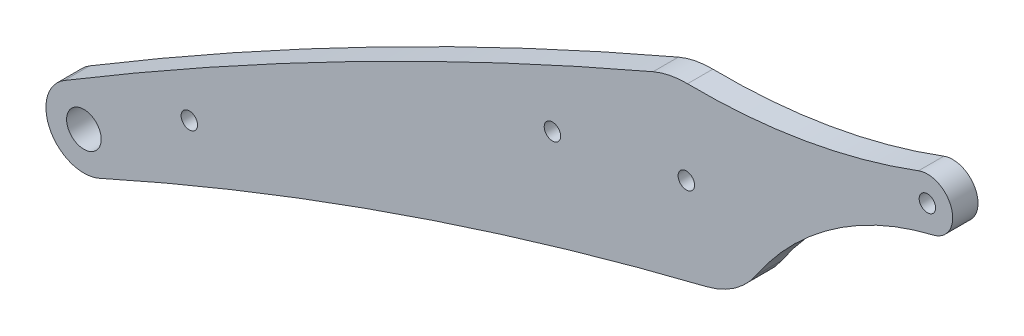
ISO-10303-21;
HEADER;
FILE_DESCRIPTION(('STEP AP214'),'2;1');
FILE_NAME('part.step','',(''),(''),'','','');
FILE_SCHEMA(('AUTOMOTIVE_DESIGN { 1 0 10303 214 1 1 1 1 }'));
ENDSEC;
DATA;
#1=APPLICATION_CONTEXT('core data for automotive mechanical design processes');
#2=APPLICATION_PROTOCOL_DEFINITION('international standard','automotive_design',2000,#1);
#3=PRODUCT_CONTEXT('',#1,'mechanical');
#4=PRODUCT('Part','Part','',(#3));
#5=PRODUCT_RELATED_PRODUCT_CATEGORY('part','',(#4));
#6=PRODUCT_DEFINITION_FORMATION('','',#4);
#7=PRODUCT_DEFINITION_CONTEXT('part definition',#1,'design');
#8=PRODUCT_DEFINITION('design','',#6,#7);
#9=PRODUCT_DEFINITION_SHAPE('','',#8);
#10=(LENGTH_UNIT() NAMED_UNIT(*) SI_UNIT(.MILLI.,.METRE.));
#11=(NAMED_UNIT(*) PLANE_ANGLE_UNIT() SI_UNIT($,.RADIAN.));
#12=(NAMED_UNIT(*) SI_UNIT($,.STERADIAN.) SOLID_ANGLE_UNIT());
#13=UNCERTAINTY_MEASURE_WITH_UNIT(LENGTH_MEASURE(1.E-05),#10,'distance_accuracy_value','');
#14=(GEOMETRIC_REPRESENTATION_CONTEXT(3) GLOBAL_UNCERTAINTY_ASSIGNED_CONTEXT((#13)) GLOBAL_UNIT_ASSIGNED_CONTEXT((#10,
#11,#12)) REPRESENTATION_CONTEXT('',''));
#15=CARTESIAN_POINT('',(0.,0.,0.));
#16=DIRECTION('',(0.,0.,1.));
#17=DIRECTION('',(1.,0.,0.));
#18=AXIS2_PLACEMENT_3D('',#15,#16,#17);
#19=CARTESIAN_POINT('',(120.891673391982,-338.257908013351,6.));
#20=DIRECTION('',(0.,0.,-1.));
#21=DIRECTION('',(-1.,0.,0.));
#22=AXIS2_PLACEMENT_3D('',#19,#20,#21);
#23=PLANE('',#22);
#24=CARTESIAN_POINT('',(343.845865484426,-857.40762459654,6.));
#25=DIRECTION('',(0.,0.,1.));
#26=DIRECTION('',(-1.,0.,0.));
#27=AXIS2_PLACEMENT_3D('',#24,#25,#26);
#28=CIRCLE('',#27,1150.);
#29=CARTESIAN_POINT('',(-109.954702491345,199.268789687827,6.));
#30=VERTEX_POINT('',#29);
#31=CARTESIAN_POINT('',(-249.547735748775,127.673100022257,6.));
#32=VERTEX_POINT('',#31);
#33=EDGE_CURVE('E146',#30,#32,#28,.T.);
#34=ORIENTED_EDGE('',*,*,#33,.T.);
#35=CARTESIAN_POINT('',(-244.90378582608,119.963772612197,6.));
#36=DIRECTION('',(0.,0.,1.));
#37=DIRECTION('',(1.,0.,0.));
#38=AXIS2_PLACEMENT_3D('',#35,#36,#37);
#39=CIRCLE('',#38,9.00000000000007);
#40=CARTESIAN_POINT('',(-241.215192404643,111.754370772152,6.));
#41=VERTEX_POINT('',#40);
#42=EDGE_CURVE('E94',#32,#41,#39,.T.);
#43=ORIENTED_EDGE('',*,*,#42,.T.);
#44=CARTESIAN_POINT('',(107.151964064457,-663.578025232061,6.));
#45=DIRECTION('',(0.,0.,-1.));
#46=DIRECTION('',(1.,0.,0.));
#47=AXIS2_PLACEMENT_3D('',#44,#45,#46);
#48=CIRCLE('',#47,850.);
#49=CARTESIAN_POINT('',(-97.2529903610391,161.478708942208,6.));
#50=VERTEX_POINT('',#49);
#51=EDGE_CURVE('E161',#41,#50,#48,.T.);
#52=ORIENTED_EDGE('',*,*,#51,.T.);
#53=CARTESIAN_POINT('',(-102.062518700463,180.891808569838,6.));
#54=DIRECTION('',(0.,0.,1.));
#55=DIRECTION('',(1.,0.,0.));
#56=AXIS2_PLACEMENT_3D('',#53,#54,#55);
#57=CIRCLE('',#56,20.0000000000002);
#58=CARTESIAN_POINT('',(-85.4373245270514,169.774123617638,6.));
#59=VERTEX_POINT('',#58);
#60=EDGE_CURVE('E174',#50,#59,#57,.T.);
#61=ORIENTED_EDGE('',*,*,#60,.T.);
#62=CARTESIAN_POINT('',(-27.2491449201124,130.862226284938,6.));
#63=DIRECTION('',(0.,0.,-1.));
#64=DIRECTION('',(-1.,0.,0.));
#65=AXIS2_PLACEMENT_3D('',#62,#63,#64);
#66=CIRCLE('',#65,70.);
#67=CARTESIAN_POINT('',(-43.5099983861352,198.947354209886,6.));
#68=VERTEX_POINT('',#67);
#69=EDGE_CURVE('E113',#59,#68,#66,.T.);
#70=ORIENTED_EDGE('',*,*,#69,.T.);
#71=CARTESIAN_POINT('',(-44.90378582608,204.783222317738,6.));
#72=DIRECTION('',(0.,0.,1.));
#73=DIRECTION('',(1.,0.,0.));
#74=AXIS2_PLACEMENT_3D('',#71,#72,#73);
#75=CIRCLE('',#74,6.00000000000002);
#76=CARTESIAN_POINT('',(-47.0081013739452,210.402106199348,6.));
#77=VERTEX_POINT('',#76);
#78=EDGE_CURVE('E107',#68,#77,#75,.T.);
#79=ORIENTED_EDGE('',*,*,#78,.T.);
#80=CARTESIAN_POINT('',(-99.6159900705748,350.874203239589,6.));
#81=DIRECTION('',(0.,0.,-1.));
#82=DIRECTION('',(1.,0.,0.));
#83=AXIS2_PLACEMENT_3D('',#80,#81,#82);
#84=CIRCLE('',#83,150.);
#85=CARTESIAN_POINT('',(-101.774691802829,200.889737354515,6.));
#86=VERTEX_POINT('',#85);
#87=EDGE_CURVE('E111',#77,#86,#84,.T.);
#88=ORIENTED_EDGE('',*,*,#87,.T.);
#89=CARTESIAN_POINT('',(-102.062518700463,180.891808569838,6.));
#90=DIRECTION('',(0.,0.,1.));
#91=DIRECTION('',(-1.,0.,0.));
#92=AXIS2_PLACEMENT_3D('',#89,#90,#91);
#93=CIRCLE('',#92,19.9999999999998);
#94=EDGE_CURVE('E51',#86,#30,#93,.T.);
#95=ORIENTED_EDGE('',*,*,#94,.T.);
#96=EDGE_LOOP('',(#34,#43,#52,#61,#70,#79,#88,#95));
#97=FACE_BOUND('',#96,.T.);
#98=CARTESIAN_POINT('',(-102.062518700463,180.891808569838,6.));
#99=DIRECTION('',(0.,0.,1.));
#100=DIRECTION('',(1.,0.,0.));
#101=AXIS2_PLACEMENT_3D('',#98,#99,#100);
#102=CIRCLE('',#101,1.95);
#103=CARTESIAN_POINT('',(-100.112518700463,180.891808569838,6.));
#104=VERTEX_POINT('',#103);
#105=EDGE_CURVE('E135',#104,#104,#102,.T.);
#106=ORIENTED_EDGE('',*,*,#105,.F.);
#107=EDGE_LOOP('',(#106));
#108=FACE_BOUND('',#107,.T.);
#109=CARTESIAN_POINT('',(-44.90378582608,204.783222317738,6.));
#110=DIRECTION('',(0.,0.,1.));
#111=DIRECTION('',(1.,0.,0.));
#112=AXIS2_PLACEMENT_3D('',#109,#110,#111);
#113=CIRCLE('',#112,1.95);
#114=CARTESIAN_POINT('',(-42.95378582608,204.783222317738,6.));
#115=VERTEX_POINT('',#114);
#116=EDGE_CURVE('E183',#115,#115,#113,.T.);
#117=ORIENTED_EDGE('',*,*,#116,.F.);
#118=EDGE_LOOP('',(#117));
#119=FACE_BOUND('',#118,.T.);
#120=CARTESIAN_POINT('',(-244.90378582608,119.963772612197,6.));
#121=DIRECTION('',(0.,0.,1.));
#122=DIRECTION('',(1.,0.,0.));
#123=AXIS2_PLACEMENT_3D('',#120,#121,#122);
#124=CIRCLE('',#123,4.09999999999998);
#125=CARTESIAN_POINT('',(-240.80378582608,119.963772612197,6.));
#126=VERTEX_POINT('',#125);
#127=EDGE_CURVE('E189',#126,#126,#124,.T.);
#128=ORIENTED_EDGE('',*,*,#127,.F.);
#129=EDGE_LOOP('',(#128));
#130=FACE_BOUND('',#129,.T.);
#131=CARTESIAN_POINT('',(-219.90378582608,134.304249979282,6.));
#132=DIRECTION('',(0.,0.,1.));
#133=DIRECTION('',(1.,0.,0.));
#134=AXIS2_PLACEMENT_3D('',#131,#132,#133);
#135=CIRCLE('',#134,1.95);
#136=CARTESIAN_POINT('',(-217.95378582608,134.304249979282,6.));
#137=VERTEX_POINT('',#136);
#138=EDGE_CURVE('E195',#137,#137,#135,.T.);
#139=ORIENTED_EDGE('',*,*,#138,.F.);
#140=EDGE_LOOP('',(#139));
#141=FACE_BOUND('',#140,.T.);
#142=CARTESIAN_POINT('',(-133.812518700463,175.069049715559,6.));
#143=DIRECTION('',(0.,0.,1.));
#144=DIRECTION('',(1.,0.,0.));
#145=AXIS2_PLACEMENT_3D('',#142,#143,#144);
#146=CIRCLE('',#145,1.95);
#147=CARTESIAN_POINT('',(-131.862518700463,175.069049715559,6.));
#148=VERTEX_POINT('',#147);
#149=EDGE_CURVE('E201',#148,#148,#146,.T.);
#150=ORIENTED_EDGE('',*,*,#149,.F.);
#151=EDGE_LOOP('',(#150));
#152=FACE_BOUND('',#151,.T.);
#153=ADVANCED_FACE('F34',(#97,#108,#119,#130,#141,#152),#23,.F.);
#154=CARTESIAN_POINT('',(120.891673391982,-338.257908013351,0.));
#155=DIRECTION('',(0.,0.,-1.));
#156=DIRECTION('',(-1.,0.,0.));
#157=AXIS2_PLACEMENT_3D('',#154,#155,#156);
#158=PLANE('',#157);
#159=CARTESIAN_POINT('',(-219.90378582608,134.304249979282,0.));
#160=DIRECTION('',(0.,0.,1.));
#161=DIRECTION('',(1.,0.,0.));
#162=AXIS2_PLACEMENT_3D('',#159,#160,#161);
#163=CIRCLE('',#162,1.95);
#164=CARTESIAN_POINT('',(-217.95378582608,134.304249979282,0.));
#165=VERTEX_POINT('',#164);
#166=EDGE_CURVE('E198',#165,#165,#163,.T.);
#167=ORIENTED_EDGE('',*,*,#166,.T.);
#168=EDGE_LOOP('',(#167));
#169=FACE_BOUND('',#168,.T.);
#170=CARTESIAN_POINT('',(-44.90378582608,204.783222317738,0.));
#171=DIRECTION('',(0.,0.,1.));
#172=DIRECTION('',(1.,0.,0.));
#173=AXIS2_PLACEMENT_3D('',#170,#171,#172);
#174=CIRCLE('',#173,1.95);
#175=CARTESIAN_POINT('',(-42.95378582608,204.783222317738,0.));
#176=VERTEX_POINT('',#175);
#177=EDGE_CURVE('E186',#176,#176,#174,.T.);
#178=ORIENTED_EDGE('',*,*,#177,.T.);
#179=EDGE_LOOP('',(#178));
#180=FACE_BOUND('',#179,.T.);
#181=CARTESIAN_POINT('',(343.845865484426,-857.40762459654,0.));
#182=DIRECTION('',(0.,0.,1.));
#183=DIRECTION('',(-1.,0.,0.));
#184=AXIS2_PLACEMENT_3D('',#181,#182,#183);
#185=CIRCLE('',#184,1150.);
#186=CARTESIAN_POINT('',(-109.954702491345,199.268789687827,0.));
#187=VERTEX_POINT('',#186);
#188=CARTESIAN_POINT('',(-249.547735748775,127.673100022257,0.));
#189=VERTEX_POINT('',#188);
#190=EDGE_CURVE('E131',#187,#189,#185,.T.);
#191=ORIENTED_EDGE('',*,*,#190,.F.);
#192=CARTESIAN_POINT('',(-102.062518700463,180.891808569838,0.));
#193=DIRECTION('',(0.,0.,1.));
#194=DIRECTION('',(-1.,0.,0.));
#195=AXIS2_PLACEMENT_3D('',#192,#193,#194);
#196=CIRCLE('',#195,19.9999999999998);
#197=CARTESIAN_POINT('',(-101.774691802829,200.889737354515,0.));
#198=VERTEX_POINT('',#197);
#199=EDGE_CURVE('E86',#198,#187,#196,.T.);
#200=ORIENTED_EDGE('',*,*,#199,.F.);
#201=CARTESIAN_POINT('',(-99.6159900705748,350.874203239589,0.));
#202=DIRECTION('',(0.,0.,-1.));
#203=DIRECTION('',(1.,0.,0.));
#204=AXIS2_PLACEMENT_3D('',#201,#202,#203);
#205=CIRCLE('',#204,150.);
#206=CARTESIAN_POINT('',(-47.0081013739452,210.402106199348,0.));
#207=VERTEX_POINT('',#206);
#208=EDGE_CURVE('E80',#207,#198,#205,.T.);
#209=ORIENTED_EDGE('',*,*,#208,.F.);
#210=CARTESIAN_POINT('',(-44.90378582608,204.783222317738,0.));
#211=DIRECTION('',(0.,0.,1.));
#212=DIRECTION('',(1.,0.,0.));
#213=AXIS2_PLACEMENT_3D('',#210,#211,#212);
#214=CIRCLE('',#213,6.00000000000002);
#215=CARTESIAN_POINT('',(-43.5099983861352,198.947354209886,0.));
#216=VERTEX_POINT('',#215);
#217=EDGE_CURVE('E121',#216,#207,#214,.T.);
#218=ORIENTED_EDGE('',*,*,#217,.F.);
#219=CARTESIAN_POINT('',(-27.2491449201124,130.862226284938,0.));
#220=DIRECTION('',(0.,0.,-1.));
#221=DIRECTION('',(-1.,0.,0.));
#222=AXIS2_PLACEMENT_3D('',#219,#220,#221);
#223=CIRCLE('',#222,70.);
#224=CARTESIAN_POINT('',(-85.4373245270514,169.774123617638,0.));
#225=VERTEX_POINT('',#224);
#226=EDGE_CURVE('E141',#225,#216,#223,.T.);
#227=ORIENTED_EDGE('',*,*,#226,.F.);
#228=CARTESIAN_POINT('',(-102.062518700463,180.891808569838,0.));
#229=DIRECTION('',(0.,0.,1.));
#230=DIRECTION('',(1.,0.,0.));
#231=AXIS2_PLACEMENT_3D('',#228,#229,#230);
#232=CIRCLE('',#231,20.0000000000002);
#233=CARTESIAN_POINT('',(-97.2529903610391,161.478708942208,0.));
#234=VERTEX_POINT('',#233);
#235=EDGE_CURVE('E139',#234,#225,#232,.T.);
#236=ORIENTED_EDGE('',*,*,#235,.F.);
#237=CARTESIAN_POINT('',(107.151964064457,-663.578025232061,0.));
#238=DIRECTION('',(0.,0.,-1.));
#239=DIRECTION('',(1.,0.,0.));
#240=AXIS2_PLACEMENT_3D('',#237,#238,#239);
#241=CIRCLE('',#240,850.);
#242=CARTESIAN_POINT('',(-241.215192404643,111.754370772152,0.));
#243=VERTEX_POINT('',#242);
#244=EDGE_CURVE('E137',#243,#234,#241,.T.);
#245=ORIENTED_EDGE('',*,*,#244,.F.);
#246=CARTESIAN_POINT('',(-244.90378582608,119.963772612197,0.));
#247=DIRECTION('',(0.,0.,1.));
#248=DIRECTION('',(1.,0.,0.));
#249=AXIS2_PLACEMENT_3D('',#246,#247,#248);
#250=CIRCLE('',#249,9.00000000000007);
#251=EDGE_CURVE('E134',#189,#243,#250,.T.);
#252=ORIENTED_EDGE('',*,*,#251,.F.);
#253=EDGE_LOOP('',(#191,#200,#209,#218,#227,#236,#245,#252));
#254=FACE_BOUND('',#253,.T.);
#255=CARTESIAN_POINT('',(-102.062518700463,180.891808569838,0.));
#256=DIRECTION('',(0.,0.,1.));
#257=DIRECTION('',(1.,0.,0.));
#258=AXIS2_PLACEMENT_3D('',#255,#256,#257);
#259=CIRCLE('',#258,1.95);
#260=CARTESIAN_POINT('',(-100.112518700463,180.891808569838,0.));
#261=VERTEX_POINT('',#260);
#262=EDGE_CURVE('E180',#261,#261,#259,.T.);
#263=ORIENTED_EDGE('',*,*,#262,.T.);
#264=EDGE_LOOP('',(#263));
#265=FACE_BOUND('',#264,.T.);
#266=CARTESIAN_POINT('',(-244.90378582608,119.963772612197,0.));
#267=DIRECTION('',(0.,0.,1.));
#268=DIRECTION('',(1.,0.,0.));
#269=AXIS2_PLACEMENT_3D('',#266,#267,#268);
#270=CIRCLE('',#269,4.09999999999998);
#271=CARTESIAN_POINT('',(-240.80378582608,119.963772612197,0.));
#272=VERTEX_POINT('',#271);
#273=EDGE_CURVE('E192',#272,#272,#270,.T.);
#274=ORIENTED_EDGE('',*,*,#273,.T.);
#275=EDGE_LOOP('',(#274));
#276=FACE_BOUND('',#275,.T.);
#277=CARTESIAN_POINT('',(-133.812518700463,175.069049715559,0.));
#278=DIRECTION('',(0.,0.,1.));
#279=DIRECTION('',(1.,0.,0.));
#280=AXIS2_PLACEMENT_3D('',#277,#278,#279);
#281=CIRCLE('',#280,1.95);
#282=CARTESIAN_POINT('',(-131.862518700463,175.069049715559,0.));
#283=VERTEX_POINT('',#282);
#284=EDGE_CURVE('E204',#283,#283,#281,.T.);
#285=ORIENTED_EDGE('',*,*,#284,.T.);
#286=EDGE_LOOP('',(#285));
#287=FACE_BOUND('',#286,.T.);
#288=ADVANCED_FACE('F165',(#169,#180,#254,#265,#276,#287),#158,.T.);
#289=CARTESIAN_POINT('',(343.845865484426,-857.40762459654,6.));
#290=DIRECTION('',(0.,0.,-1.));
#291=DIRECTION('',(-1.,0.,0.));
#292=AXIS2_PLACEMENT_3D('',#289,#290,#291);
#293=CYLINDRICAL_SURFACE('',#292,1150.);
#294=ORIENTED_EDGE('',*,*,#190,.T.);
#295=DIRECTION('',(0.,0.,-1.));
#296=VECTOR('',#295,1.);
#297=CARTESIAN_POINT('',(-249.547735748775,127.673100022257,6.));
#298=LINE('',#297,#296);
#299=EDGE_CURVE('E11',#32,#189,#298,.T.);
#300=ORIENTED_EDGE('',*,*,#299,.F.);
#301=ORIENTED_EDGE('',*,*,#33,.F.);
#302=DIRECTION('',(0.,0.,-1.));
#303=VECTOR('',#302,1.);
#304=CARTESIAN_POINT('',(-109.954702491345,199.268789687827,6.));
#305=LINE('',#304,#303);
#306=EDGE_CURVE('E127',#30,#187,#305,.T.);
#307=ORIENTED_EDGE('',*,*,#306,.T.);
#308=EDGE_LOOP('',(#294,#300,#301,#307));
#309=FACE_BOUND('',#308,.T.);
#310=ADVANCED_FACE('F36',(#309),#293,.T.);
#311=CARTESIAN_POINT('',(-244.90378582608,119.963772612197,6.));
#312=DIRECTION('',(0.,0.,-1.));
#313=DIRECTION('',(-1.,0.,0.));
#314=AXIS2_PLACEMENT_3D('',#311,#312,#313);
#315=CYLINDRICAL_SURFACE('',#314,9.00000000000007);
#316=ORIENTED_EDGE('',*,*,#251,.T.);
#317=DIRECTION('',(0.,0.,-1.));
#318=VECTOR('',#317,1.);
#319=CARTESIAN_POINT('',(-241.215192404643,111.754370772152,6.));
#320=LINE('',#319,#318);
#321=EDGE_CURVE('E43',#41,#243,#320,.T.);
#322=ORIENTED_EDGE('',*,*,#321,.F.);
#323=ORIENTED_EDGE('',*,*,#42,.F.);
#324=ORIENTED_EDGE('',*,*,#299,.T.);
#325=EDGE_LOOP('',(#316,#322,#323,#324));
#326=FACE_BOUND('',#325,.T.);
#327=ADVANCED_FACE('F236',(#326),#315,.T.);
#328=CARTESIAN_POINT('',(107.151964064457,-663.578025232061,6.));
#329=DIRECTION('',(0.,0.,-1.));
#330=DIRECTION('',(-1.,0.,0.));
#331=AXIS2_PLACEMENT_3D('',#328,#329,#330);
#332=CYLINDRICAL_SURFACE('',#331,850.);
#333=ORIENTED_EDGE('',*,*,#244,.T.);
#334=DIRECTION('',(0.,0.,-1.));
#335=VECTOR('',#334,1.);
#336=CARTESIAN_POINT('',(-97.2529903610391,161.478708942208,6.));
#337=LINE('',#336,#335);
#338=EDGE_CURVE('E153',#50,#234,#337,.T.);
#339=ORIENTED_EDGE('',*,*,#338,.F.);
#340=ORIENTED_EDGE('',*,*,#51,.F.);
#341=ORIENTED_EDGE('',*,*,#321,.T.);
#342=EDGE_LOOP('',(#333,#339,#340,#341));
#343=FACE_BOUND('',#342,.T.);
#344=ADVANCED_FACE('F159',(#343),#332,.F.);
#345=CARTESIAN_POINT('',(-102.062518700463,180.891808569838,6.));
#346=DIRECTION('',(0.,0.,-1.));
#347=DIRECTION('',(-1.,0.,0.));
#348=AXIS2_PLACEMENT_3D('',#345,#346,#347);
#349=CYLINDRICAL_SURFACE('',#348,20.0000000000002);
#350=ORIENTED_EDGE('',*,*,#235,.T.);
#351=DIRECTION('',(0.,0.,-1.));
#352=VECTOR('',#351,1.);
#353=CARTESIAN_POINT('',(-85.4373245270514,169.774123617638,6.));
#354=LINE('',#353,#352);
#355=EDGE_CURVE('E150',#59,#225,#354,.T.);
#356=ORIENTED_EDGE('',*,*,#355,.F.);
#357=ORIENTED_EDGE('',*,*,#60,.F.);
#358=ORIENTED_EDGE('',*,*,#338,.T.);
#359=EDGE_LOOP('',(#350,#356,#357,#358));
#360=FACE_BOUND('',#359,.T.);
#361=ADVANCED_FACE('F170',(#360),#349,.T.);
#362=CARTESIAN_POINT('',(-27.2491449201124,130.862226284938,6.));
#363=DIRECTION('',(0.,0.,-1.));
#364=DIRECTION('',(-1.,0.,0.));
#365=AXIS2_PLACEMENT_3D('',#362,#363,#364);
#366=CYLINDRICAL_SURFACE('',#365,70.);
#367=ORIENTED_EDGE('',*,*,#226,.T.);
#368=DIRECTION('',(0.,0.,-1.));
#369=VECTOR('',#368,1.);
#370=CARTESIAN_POINT('',(-43.5099983861352,198.947354209886,6.));
#371=LINE('',#370,#369);
#372=EDGE_CURVE('E122',#68,#216,#371,.T.);
#373=ORIENTED_EDGE('',*,*,#372,.F.);
#374=ORIENTED_EDGE('',*,*,#69,.F.);
#375=ORIENTED_EDGE('',*,*,#355,.T.);
#376=EDGE_LOOP('',(#367,#373,#374,#375));
#377=FACE_BOUND('',#376,.T.);
#378=ADVANCED_FACE('F173',(#377),#366,.F.);
#379=CARTESIAN_POINT('',(-44.90378582608,204.783222317738,6.));
#380=DIRECTION('',(0.,0.,-1.));
#381=DIRECTION('',(-1.,0.,0.));
#382=AXIS2_PLACEMENT_3D('',#379,#380,#381);
#383=CYLINDRICAL_SURFACE('',#382,6.00000000000002);
#384=ORIENTED_EDGE('',*,*,#217,.T.);
#385=DIRECTION('',(0.,0.,-1.));
#386=VECTOR('',#385,1.);
#387=CARTESIAN_POINT('',(-47.0081013739452,210.402106199348,6.));
#388=LINE('',#387,#386);
#389=EDGE_CURVE('E118',#77,#207,#388,.T.);
#390=ORIENTED_EDGE('',*,*,#389,.F.);
#391=ORIENTED_EDGE('',*,*,#78,.F.);
#392=ORIENTED_EDGE('',*,*,#372,.T.);
#393=EDGE_LOOP('',(#384,#390,#391,#392));
#394=FACE_BOUND('',#393,.T.);
#395=ADVANCED_FACE('F119',(#394),#383,.T.);
#396=CARTESIAN_POINT('',(-99.6159900705748,350.874203239589,6.));
#397=DIRECTION('',(0.,0.,-1.));
#398=DIRECTION('',(-1.,0.,0.));
#399=AXIS2_PLACEMENT_3D('',#396,#397,#398);
#400=CYLINDRICAL_SURFACE('',#399,150.);
#401=ORIENTED_EDGE('',*,*,#208,.T.);
#402=DIRECTION('',(0.,0.,-1.));
#403=VECTOR('',#402,1.);
#404=CARTESIAN_POINT('',(-101.774691802829,200.889737354515,6.));
#405=LINE('',#404,#403);
#406=EDGE_CURVE('E123',#86,#198,#405,.T.);
#407=ORIENTED_EDGE('',*,*,#406,.F.);
#408=ORIENTED_EDGE('',*,*,#87,.F.);
#409=ORIENTED_EDGE('',*,*,#389,.T.);
#410=EDGE_LOOP('',(#401,#407,#408,#409));
#411=FACE_BOUND('',#410,.T.);
#412=ADVANCED_FACE('F125',(#411),#400,.F.);
#413=CARTESIAN_POINT('',(-102.062518700463,180.891808569838,6.));
#414=DIRECTION('',(0.,0.,-1.));
#415=DIRECTION('',(-1.,0.,0.));
#416=AXIS2_PLACEMENT_3D('',#413,#414,#415);
#417=CYLINDRICAL_SURFACE('',#416,19.9999999999998);
#418=ORIENTED_EDGE('',*,*,#199,.T.);
#419=ORIENTED_EDGE('',*,*,#306,.F.);
#420=ORIENTED_EDGE('',*,*,#94,.F.);
#421=ORIENTED_EDGE('',*,*,#406,.T.);
#422=EDGE_LOOP('',(#418,#419,#420,#421));
#423=FACE_BOUND('',#422,.T.);
#424=ADVANCED_FACE('F224',(#423),#417,.T.);
#425=CARTESIAN_POINT('',(-102.062518700463,180.891808569838,6.));
#426=DIRECTION('',(0.,0.,-1.));
#427=DIRECTION('',(-1.,0.,0.));
#428=AXIS2_PLACEMENT_3D('',#425,#426,#427);
#429=CYLINDRICAL_SURFACE('',#428,1.95);
#430=ORIENTED_EDGE('',*,*,#105,.T.);
#431=EDGE_LOOP('',(#430));
#432=FACE_BOUND('',#431,.T.);
#433=ORIENTED_EDGE('',*,*,#262,.F.);
#434=EDGE_LOOP('',(#433));
#435=FACE_BOUND('',#434,.T.);
#436=ADVANCED_FACE('F221',(#432,#435),#429,.F.);
#437=CARTESIAN_POINT('',(-44.90378582608,204.783222317738,6.));
#438=DIRECTION('',(0.,0.,-1.));
#439=DIRECTION('',(-1.,0.,0.));
#440=AXIS2_PLACEMENT_3D('',#437,#438,#439);
#441=CYLINDRICAL_SURFACE('',#440,1.95);
#442=ORIENTED_EDGE('',*,*,#116,.T.);
#443=EDGE_LOOP('',(#442));
#444=FACE_BOUND('',#443,.T.);
#445=ORIENTED_EDGE('',*,*,#177,.F.);
#446=EDGE_LOOP('',(#445));
#447=FACE_BOUND('',#446,.T.);
#448=ADVANCED_FACE('F300',(#444,#447),#441,.F.);
#449=CARTESIAN_POINT('',(-244.90378582608,119.963772612197,6.));
#450=DIRECTION('',(0.,0.,-1.));
#451=DIRECTION('',(-1.,0.,0.));
#452=AXIS2_PLACEMENT_3D('',#449,#450,#451);
#453=CYLINDRICAL_SURFACE('',#452,4.09999999999998);
#454=ORIENTED_EDGE('',*,*,#127,.T.);
#455=EDGE_LOOP('',(#454));
#456=FACE_BOUND('',#455,.T.);
#457=ORIENTED_EDGE('',*,*,#273,.F.);
#458=EDGE_LOOP('',(#457));
#459=FACE_BOUND('',#458,.T.);
#460=ADVANCED_FACE('F308',(#456,#459),#453,.F.);
#461=CARTESIAN_POINT('',(-219.90378582608,134.304249979282,6.));
#462=DIRECTION('',(0.,0.,-1.));
#463=DIRECTION('',(-1.,0.,0.));
#464=AXIS2_PLACEMENT_3D('',#461,#462,#463);
#465=CYLINDRICAL_SURFACE('',#464,1.95);
#466=ORIENTED_EDGE('',*,*,#138,.T.);
#467=EDGE_LOOP('',(#466));
#468=FACE_BOUND('',#467,.T.);
#469=ORIENTED_EDGE('',*,*,#166,.F.);
#470=EDGE_LOOP('',(#469));
#471=FACE_BOUND('',#470,.T.);
#472=ADVANCED_FACE('F316',(#468,#471),#465,.F.);
#473=CARTESIAN_POINT('',(-133.812518700463,175.069049715559,6.));
#474=DIRECTION('',(0.,0.,-1.));
#475=DIRECTION('',(-1.,0.,0.));
#476=AXIS2_PLACEMENT_3D('',#473,#474,#475);
#477=CYLINDRICAL_SURFACE('',#476,1.95);
#478=ORIENTED_EDGE('',*,*,#149,.T.);
#479=EDGE_LOOP('',(#478));
#480=FACE_BOUND('',#479,.T.);
#481=ORIENTED_EDGE('',*,*,#284,.F.);
#482=EDGE_LOOP('',(#481));
#483=FACE_BOUND('',#482,.T.);
#484=ADVANCED_FACE('F210',(#480,#483),#477,.F.);
#485=CLOSED_SHELL('',(#153,#288,#310,#327,#344,#361,#378,#395,#412,#424,#436,#448,#460,#472,#484));
#486=MANIFOLD_SOLID_BREP('B2',#485);
#487=ADVANCED_BREP_SHAPE_REPRESENTATION('',(#18,#486),#14);
#488=SHAPE_DEFINITION_REPRESENTATION(#9,#487);
ENDSEC;
END-ISO-10303-21;
